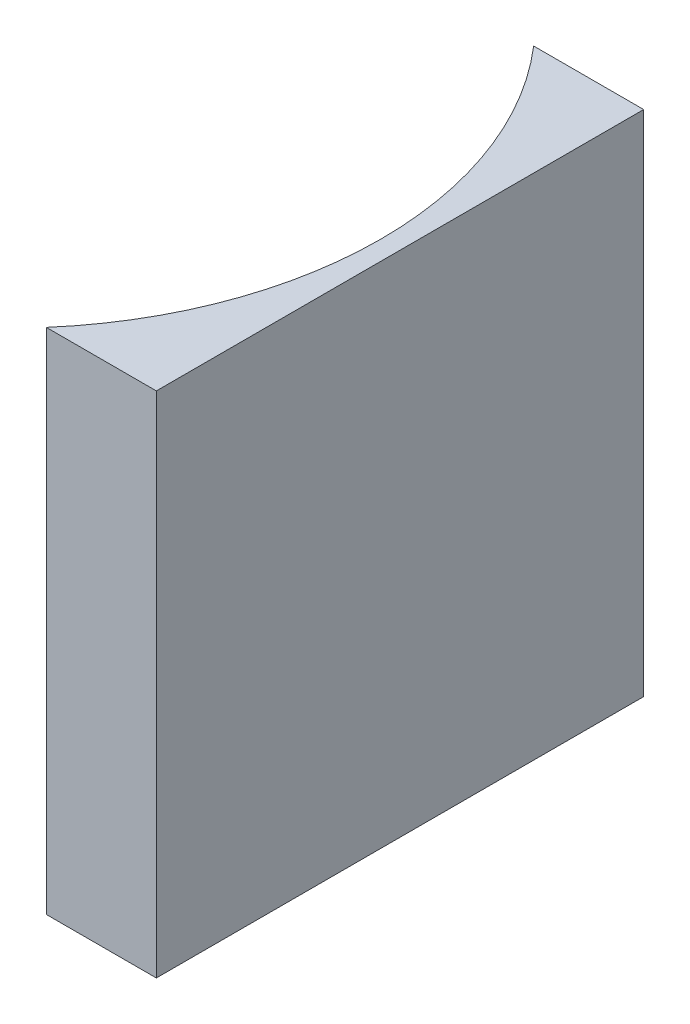
ISO-10303-21;
HEADER;
FILE_DESCRIPTION(('STEP AP214'),'2;1');
FILE_NAME('part.step','',(''),(''),'','','');
FILE_SCHEMA(('AUTOMOTIVE_DESIGN { 1 0 10303 214 1 1 1 1 }'));
ENDSEC;
DATA;
#1=APPLICATION_CONTEXT('core data for automotive mechanical design processes');
#2=APPLICATION_PROTOCOL_DEFINITION('international standard','automotive_design',2000,#1);
#3=PRODUCT_CONTEXT('',#1,'mechanical');
#4=PRODUCT('Part','Part','',(#3));
#5=PRODUCT_RELATED_PRODUCT_CATEGORY('part','',(#4));
#6=PRODUCT_DEFINITION_FORMATION('','',#4);
#7=PRODUCT_DEFINITION_CONTEXT('part definition',#1,'design');
#8=PRODUCT_DEFINITION('design','',#6,#7);
#9=PRODUCT_DEFINITION_SHAPE('','',#8);
#10=(LENGTH_UNIT() NAMED_UNIT(*) SI_UNIT(.MILLI.,.METRE.));
#11=(NAMED_UNIT(*) PLANE_ANGLE_UNIT() SI_UNIT($,.RADIAN.));
#12=(NAMED_UNIT(*) SI_UNIT($,.STERADIAN.) SOLID_ANGLE_UNIT());
#13=UNCERTAINTY_MEASURE_WITH_UNIT(LENGTH_MEASURE(1.E-05),#10,'distance_accuracy_value','');
#14=(GEOMETRIC_REPRESENTATION_CONTEXT(3) GLOBAL_UNCERTAINTY_ASSIGNED_CONTEXT((#13)) GLOBAL_UNIT_ASSIGNED_CONTEXT((#10,
#11,#12)) REPRESENTATION_CONTEXT('',''));
#15=CARTESIAN_POINT('',(0.,0.,0.));
#16=DIRECTION('',(0.,0.,1.));
#17=DIRECTION('',(1.,0.,0.));
#18=AXIS2_PLACEMENT_3D('',#15,#16,#17);
#19=CARTESIAN_POINT('',(0.,53.,0.));
#20=DIRECTION('',(0.,0.,1.));
#21=DIRECTION('',(1.,0.,0.));
#22=AXIS2_PLACEMENT_3D('',#19,#20,#21);
#23=PLANE('',#22);
#24=DIRECTION('',(-1.,0.,0.));
#25=VECTOR('',#24,1.);
#26=CARTESIAN_POINT('',(0.,0.,0.));
#27=LINE('',#26,#25);
#28=CARTESIAN_POINT('',(0.,0.,0.));
#29=VERTEX_POINT('',#28);
#30=CARTESIAN_POINT('',(-11.4694698309083,0.,0.));
#31=VERTEX_POINT('',#30);
#32=EDGE_CURVE('E99',#29,#31,#27,.T.);
#33=ORIENTED_EDGE('',*,*,#32,.T.);
#34=DIRECTION('',(0.,-1.,0.));
#35=VECTOR('',#34,1.);
#36=CARTESIAN_POINT('',(-11.4694698309083,53.,0.));
#37=LINE('',#36,#35);
#38=CARTESIAN_POINT('',(-11.4694698309083,53.,0.));
#39=VERTEX_POINT('',#38);
#40=EDGE_CURVE('E11',#39,#31,#37,.T.);
#41=ORIENTED_EDGE('',*,*,#40,.F.);
#42=DIRECTION('',(-1.,0.,0.));
#43=VECTOR('',#42,1.);
#44=CARTESIAN_POINT('',(0.,53.,0.));
#45=LINE('',#44,#43);
#46=CARTESIAN_POINT('',(0.,53.,0.));
#47=VERTEX_POINT('',#46);
#48=EDGE_CURVE('E87',#47,#39,#45,.T.);
#49=ORIENTED_EDGE('',*,*,#48,.F.);
#50=DIRECTION('',(0.,-1.,0.));
#51=VECTOR('',#50,1.);
#52=CARTESIAN_POINT('',(0.,53.,0.));
#53=LINE('',#52,#51);
#54=EDGE_CURVE('E95',#47,#29,#53,.T.);
#55=ORIENTED_EDGE('',*,*,#54,.T.);
#56=EDGE_LOOP('',(#33,#41,#49,#55));
#57=FACE_BOUND('',#56,.T.);
#58=ADVANCED_FACE('F36',(#57),#23,.F.);
#59=CARTESIAN_POINT('',(-40.8,53.,25.4));
#60=DIRECTION('',(0.,-1.,0.));
#61=DIRECTION('',(0.,0.,-1.));
#62=AXIS2_PLACEMENT_3D('',#59,#60,#61);
#63=CYLINDRICAL_SURFACE('',#62,38.8);
#64=CARTESIAN_POINT('',(-40.8,0.,25.4));
#65=DIRECTION('',(0.,-1.,0.));
#66=DIRECTION('',(0.,0.,1.));
#67=AXIS2_PLACEMENT_3D('',#64,#65,#66);
#68=CIRCLE('',#67,38.8);
#69=CARTESIAN_POINT('',(-11.4694698309083,0.,50.8));
#70=VERTEX_POINT('',#69);
#71=EDGE_CURVE('E91',#31,#70,#68,.T.);
#72=ORIENTED_EDGE('',*,*,#71,.T.);
#73=DIRECTION('',(0.,-1.,0.));
#74=VECTOR('',#73,1.);
#75=CARTESIAN_POINT('',(-11.4694698309083,53.,50.8));
#76=LINE('',#75,#74);
#77=CARTESIAN_POINT('',(-11.4694698309083,53.,50.8));
#78=VERTEX_POINT('',#77);
#79=EDGE_CURVE('E44',#78,#70,#76,.T.);
#80=ORIENTED_EDGE('',*,*,#79,.F.);
#81=CARTESIAN_POINT('',(-40.8,53.,25.4));
#82=DIRECTION('',(0.,-1.,0.));
#83=DIRECTION('',(0.,0.,1.));
#84=AXIS2_PLACEMENT_3D('',#81,#82,#83);
#85=CIRCLE('',#84,38.8);
#86=EDGE_CURVE('E82',#39,#78,#85,.T.);
#87=ORIENTED_EDGE('',*,*,#86,.F.);
#88=ORIENTED_EDGE('',*,*,#40,.T.);
#89=EDGE_LOOP('',(#72,#80,#87,#88));
#90=FACE_BOUND('',#89,.T.);
#91=ADVANCED_FACE('F90',(#90),#63,.F.);
#92=CARTESIAN_POINT('',(0.,53.,50.8));
#93=DIRECTION('',(0.,0.,-1.));
#94=DIRECTION('',(-1.,0.,0.));
#95=AXIS2_PLACEMENT_3D('',#92,#93,#94);
#96=PLANE('',#95);
#97=DIRECTION('',(1.,0.,0.));
#98=VECTOR('',#97,1.);
#99=CARTESIAN_POINT('',(0.,0.,50.8));
#100=LINE('',#99,#98);
#101=CARTESIAN_POINT('',(0.,0.,50.8));
#102=VERTEX_POINT('',#101);
#103=EDGE_CURVE('E69',#70,#102,#100,.T.);
#104=ORIENTED_EDGE('',*,*,#103,.T.);
#105=DIRECTION('',(0.,-1.,0.));
#106=VECTOR('',#105,1.);
#107=CARTESIAN_POINT('',(0.,53.,50.8));
#108=LINE('',#107,#106);
#109=CARTESIAN_POINT('',(0.,53.,50.8));
#110=VERTEX_POINT('',#109);
#111=EDGE_CURVE('E92',#110,#102,#108,.T.);
#112=ORIENTED_EDGE('',*,*,#111,.F.);
#113=DIRECTION('',(1.,0.,0.));
#114=VECTOR('',#113,1.);
#115=CARTESIAN_POINT('',(0.,53.,50.8));
#116=LINE('',#115,#114);
#117=EDGE_CURVE('E85',#78,#110,#116,.T.);
#118=ORIENTED_EDGE('',*,*,#117,.F.);
#119=ORIENTED_EDGE('',*,*,#79,.T.);
#120=EDGE_LOOP('',(#104,#112,#118,#119));
#121=FACE_BOUND('',#120,.T.);
#122=ADVANCED_FACE('F93',(#121),#96,.F.);
#123=CARTESIAN_POINT('',(0.,53.,0.));
#124=DIRECTION('',(-1.,0.,0.));
#125=DIRECTION('',(0.,0.,1.));
#126=AXIS2_PLACEMENT_3D('',#123,#124,#125);
#127=PLANE('',#126);
#128=DIRECTION('',(0.,0.,-1.));
#129=VECTOR('',#128,1.);
#130=CARTESIAN_POINT('',(0.,0.,0.));
#131=LINE('',#130,#129);
#132=EDGE_CURVE('E75',#102,#29,#131,.T.);
#133=ORIENTED_EDGE('',*,*,#132,.T.);
#134=ORIENTED_EDGE('',*,*,#54,.F.);
#135=DIRECTION('',(0.,0.,-1.));
#136=VECTOR('',#135,1.);
#137=CARTESIAN_POINT('',(0.,53.,0.));
#138=LINE('',#137,#136);
#139=EDGE_CURVE('E52',#110,#47,#138,.T.);
#140=ORIENTED_EDGE('',*,*,#139,.F.);
#141=ORIENTED_EDGE('',*,*,#111,.T.);
#142=EDGE_LOOP('',(#133,#134,#140,#141));
#143=FACE_BOUND('',#142,.T.);
#144=ADVANCED_FACE('F106',(#143),#127,.F.);
#145=CARTESIAN_POINT('',(-40.8,53.,25.4));
#146=DIRECTION('',(0.,1.,0.));
#147=DIRECTION('',(0.,0.,1.));
#148=AXIS2_PLACEMENT_3D('',#145,#146,#147);
#149=PLANE('',#148);
#150=ORIENTED_EDGE('',*,*,#48,.T.);
#151=ORIENTED_EDGE('',*,*,#86,.T.);
#152=ORIENTED_EDGE('',*,*,#117,.T.);
#153=ORIENTED_EDGE('',*,*,#139,.T.);
#154=EDGE_LOOP('',(#150,#151,#152,#153));
#155=FACE_BOUND('',#154,.T.);
#156=ADVANCED_FACE('F83',(#155),#149,.T.);
#157=CARTESIAN_POINT('',(-40.8,0.,25.4));
#158=DIRECTION('',(0.,1.,0.));
#159=DIRECTION('',(0.,0.,1.));
#160=AXIS2_PLACEMENT_3D('',#157,#158,#159);
#161=PLANE('',#160);
#162=ORIENTED_EDGE('',*,*,#32,.F.);
#163=ORIENTED_EDGE('',*,*,#132,.F.);
#164=ORIENTED_EDGE('',*,*,#103,.F.);
#165=ORIENTED_EDGE('',*,*,#71,.F.);
#166=EDGE_LOOP('',(#162,#163,#164,#165));
#167=FACE_BOUND('',#166,.T.);
#168=ADVANCED_FACE('F109',(#167),#161,.F.);
#169=CLOSED_SHELL('',(#58,#91,#122,#144,#156,#168));
#170=MANIFOLD_SOLID_BREP('B2',#169);
#171=ADVANCED_BREP_SHAPE_REPRESENTATION('',(#18,#170),#14);
#172=SHAPE_DEFINITION_REPRESENTATION(#9,#171);
ENDSEC;
END-ISO-10303-21;
